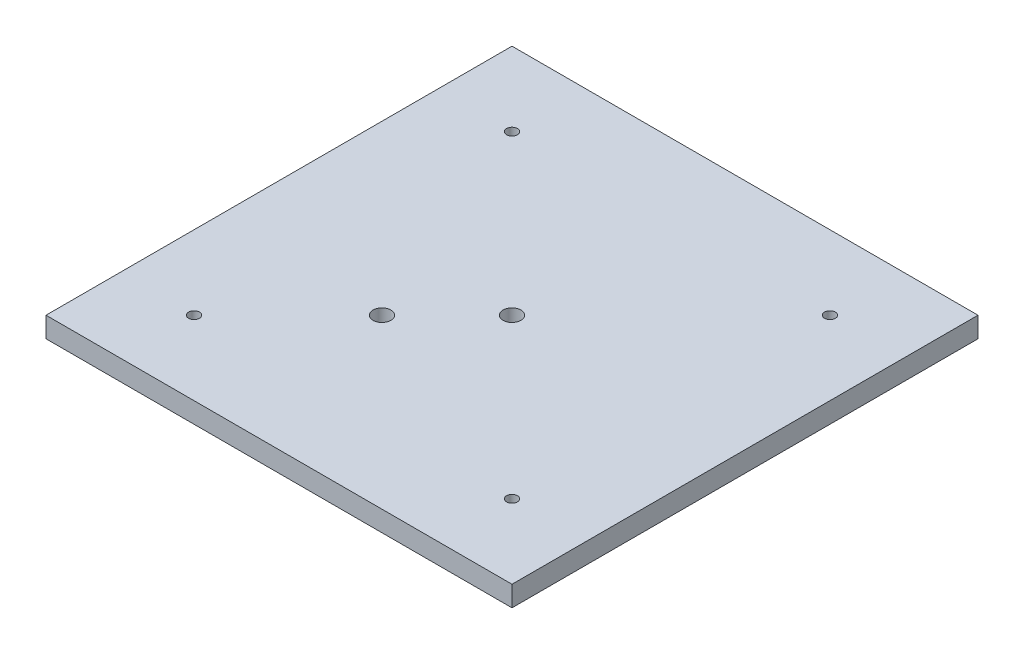
ISO-10303-21;
HEADER;
FILE_DESCRIPTION(('STEP AP214'),'2;1');
FILE_NAME('part.step','',(''),(''),'','','');
FILE_SCHEMA(('AUTOMOTIVE_DESIGN { 1 0 10303 214 1 1 1 1 }'));
ENDSEC;
DATA;
#1=APPLICATION_CONTEXT('core data for automotive mechanical design processes');
#2=APPLICATION_PROTOCOL_DEFINITION('international standard','automotive_design',2000,#1);
#3=PRODUCT_CONTEXT('',#1,'mechanical');
#4=PRODUCT('Part','Part','',(#3));
#5=PRODUCT_RELATED_PRODUCT_CATEGORY('part','',(#4));
#6=PRODUCT_DEFINITION_FORMATION('','',#4);
#7=PRODUCT_DEFINITION_CONTEXT('part definition',#1,'design');
#8=PRODUCT_DEFINITION('design','',#6,#7);
#9=PRODUCT_DEFINITION_SHAPE('','',#8);
#10=(LENGTH_UNIT() NAMED_UNIT(*) SI_UNIT(.MILLI.,.METRE.));
#11=(NAMED_UNIT(*) PLANE_ANGLE_UNIT() SI_UNIT($,.RADIAN.));
#12=(NAMED_UNIT(*) SI_UNIT($,.STERADIAN.) SOLID_ANGLE_UNIT());
#13=UNCERTAINTY_MEASURE_WITH_UNIT(LENGTH_MEASURE(1.E-05),#10,'distance_accuracy_value','');
#14=(GEOMETRIC_REPRESENTATION_CONTEXT(3) GLOBAL_UNCERTAINTY_ASSIGNED_CONTEXT((#13)) GLOBAL_UNIT_ASSIGNED_CONTEXT((#10,
#11,#12)) REPRESENTATION_CONTEXT('',''));
#15=CARTESIAN_POINT('',(0.,0.,0.));
#16=DIRECTION('',(0.,0.,1.));
#17=DIRECTION('',(1.,0.,0.));
#18=AXIS2_PLACEMENT_3D('',#15,#16,#17);
#19=CARTESIAN_POINT('',(0.,0.,0.));
#20=DIRECTION('',(0.,-1.,0.));
#21=DIRECTION('',(0.,0.,-1.));
#22=AXIS2_PLACEMENT_3D('',#19,#20,#21);
#23=PLANE('',#22);
#24=CARTESIAN_POINT('',(0.,0.,0.));
#25=DIRECTION('',(0.,1.,0.));
#26=DIRECTION('',(0.,0.,1.));
#27=AXIS2_PLACEMENT_3D('',#24,#25,#26);
#28=CIRCLE('',#27,5.5626);
#29=CARTESIAN_POINT('',(0.,0.,5.5626));
#30=VERTEX_POINT('',#29);
#31=EDGE_CURVE('E104',#30,#30,#28,.T.);
#32=ORIENTED_EDGE('',*,*,#31,.T.);
#33=EDGE_LOOP('',(#32));
#34=FACE_BOUND('',#33,.T.);
#35=CARTESIAN_POINT('',(-40.4111525448112,0.,40.4111525448112));
#36=DIRECTION('',(0.,1.,0.));
#37=DIRECTION('',(0.,0.,1.));
#38=AXIS2_PLACEMENT_3D('',#35,#36,#37);
#39=CIRCLE('',#38,5.5626);
#40=CARTESIAN_POINT('',(-40.4111525448112,0.,45.9737525448112));
#41=VERTEX_POINT('',#40);
#42=EDGE_CURVE('E120',#41,#41,#39,.T.);
#43=ORIENTED_EDGE('',*,*,#42,.T.);
#44=EDGE_LOOP('',(#43));
#45=FACE_BOUND('',#44,.T.);
#46=CARTESIAN_POINT('',(0.,0.,0.));
#47=DIRECTION('',(0.,-1.,0.));
#48=DIRECTION('',(0.,0.,-1.));
#49=AXIS2_PLACEMENT_3D('',#46,#47,#48);
#50=CIRCLE('',#49,123.19);
#51=CARTESIAN_POINT('',(0.,0.,-123.19));
#52=VERTEX_POINT('',#51);
#53=EDGE_CURVE('E139',#52,#52,#50,.T.);
#54=ORIENTED_EDGE('',*,*,#53,.T.);
#55=EDGE_LOOP('',(#54));
#56=FACE_BOUND('',#55,.T.);
#57=ADVANCED_FACE('F37',(#34,#45,#56),#23,.T.);
#58=CARTESIAN_POINT('',(144.78,12.7,144.78));
#59=DIRECTION('',(-1.,0.,0.));
#60=DIRECTION('',(0.,0.,1.));
#61=AXIS2_PLACEMENT_3D('',#58,#59,#60);
#62=PLANE('',#61);
#63=DIRECTION('',(0.,0.,-1.));
#64=VECTOR('',#63,1.);
#65=CARTESIAN_POINT('',(144.78,0.,144.78));
#66=LINE('',#65,#64);
#67=CARTESIAN_POINT('',(144.78,0.,144.78));
#68=VERTEX_POINT('',#67);
#69=CARTESIAN_POINT('',(144.78,0.,-144.78));
#70=VERTEX_POINT('',#69);
#71=EDGE_CURVE('E101',#68,#70,#66,.T.);
#72=ORIENTED_EDGE('',*,*,#71,.T.);
#73=DIRECTION('',(0.,-1.,0.));
#74=VECTOR('',#73,1.);
#75=CARTESIAN_POINT('',(144.78,12.7,-144.78));
#76=LINE('',#75,#74);
#77=CARTESIAN_POINT('',(144.78,12.7,-144.78));
#78=VERTEX_POINT('',#77);
#79=EDGE_CURVE('E11',#78,#70,#76,.T.);
#80=ORIENTED_EDGE('',*,*,#79,.F.);
#81=DIRECTION('',(0.,0.,-1.));
#82=VECTOR('',#81,1.);
#83=CARTESIAN_POINT('',(144.78,12.7,144.78));
#84=LINE('',#83,#82);
#85=CARTESIAN_POINT('',(144.78,12.7,144.78));
#86=VERTEX_POINT('',#85);
#87=EDGE_CURVE('E89',#86,#78,#84,.T.);
#88=ORIENTED_EDGE('',*,*,#87,.F.);
#89=DIRECTION('',(0.,-1.,0.));
#90=VECTOR('',#89,1.);
#91=CARTESIAN_POINT('',(144.78,12.7,144.78));
#92=LINE('',#91,#90);
#93=EDGE_CURVE('E97',#86,#68,#92,.T.);
#94=ORIENTED_EDGE('',*,*,#93,.T.);
#95=EDGE_LOOP('',(#72,#80,#88,#94));
#96=FACE_BOUND('',#95,.T.);
#97=ADVANCED_FACE('F39',(#96),#62,.F.);
#98=CARTESIAN_POINT('',(-144.78,12.7,-144.78));
#99=DIRECTION('',(0.,0.,1.));
#100=DIRECTION('',(1.,0.,0.));
#101=AXIS2_PLACEMENT_3D('',#98,#99,#100);
#102=PLANE('',#101);
#103=DIRECTION('',(-1.,0.,0.));
#104=VECTOR('',#103,1.);
#105=CARTESIAN_POINT('',(-144.78,0.,-144.78));
#106=LINE('',#105,#104);
#107=CARTESIAN_POINT('',(-144.78,0.,-144.78));
#108=VERTEX_POINT('',#107);
#109=EDGE_CURVE('E93',#70,#108,#106,.T.);
#110=ORIENTED_EDGE('',*,*,#109,.T.);
#111=DIRECTION('',(0.,-1.,0.));
#112=VECTOR('',#111,1.);
#113=CARTESIAN_POINT('',(-144.78,12.7,-144.78));
#114=LINE('',#113,#112);
#115=CARTESIAN_POINT('',(-144.78,12.7,-144.78));
#116=VERTEX_POINT('',#115);
#117=EDGE_CURVE('E46',#116,#108,#114,.T.);
#118=ORIENTED_EDGE('',*,*,#117,.F.);
#119=DIRECTION('',(-1.,0.,0.));
#120=VECTOR('',#119,1.);
#121=CARTESIAN_POINT('',(-144.78,12.7,-144.78));
#122=LINE('',#121,#120);
#123=EDGE_CURVE('E84',#78,#116,#122,.T.);
#124=ORIENTED_EDGE('',*,*,#123,.F.);
#125=ORIENTED_EDGE('',*,*,#79,.T.);
#126=EDGE_LOOP('',(#110,#118,#124,#125));
#127=FACE_BOUND('',#126,.T.);
#128=ADVANCED_FACE('F92',(#127),#102,.F.);
#129=CARTESIAN_POINT('',(-144.78,12.7,144.78));
#130=DIRECTION('',(1.,0.,0.));
#131=DIRECTION('',(0.,0.,-1.));
#132=AXIS2_PLACEMENT_3D('',#129,#130,#131);
#133=PLANE('',#132);
#134=DIRECTION('',(0.,0.,1.));
#135=VECTOR('',#134,1.);
#136=CARTESIAN_POINT('',(-144.78,0.,144.78));
#137=LINE('',#136,#135);
#138=CARTESIAN_POINT('',(-144.78,0.,144.78));
#139=VERTEX_POINT('',#138);
#140=EDGE_CURVE('E71',#108,#139,#137,.T.);
#141=ORIENTED_EDGE('',*,*,#140,.T.);
#142=DIRECTION('',(0.,-1.,0.));
#143=VECTOR('',#142,1.);
#144=CARTESIAN_POINT('',(-144.78,12.7,144.78));
#145=LINE('',#144,#143);
#146=CARTESIAN_POINT('',(-144.78,12.7,144.78));
#147=VERTEX_POINT('',#146);
#148=EDGE_CURVE('E94',#147,#139,#145,.T.);
#149=ORIENTED_EDGE('',*,*,#148,.F.);
#150=DIRECTION('',(0.,0.,1.));
#151=VECTOR('',#150,1.);
#152=CARTESIAN_POINT('',(-144.78,12.7,144.78));
#153=LINE('',#152,#151);
#154=EDGE_CURVE('E87',#116,#147,#153,.T.);
#155=ORIENTED_EDGE('',*,*,#154,.F.);
#156=ORIENTED_EDGE('',*,*,#117,.T.);
#157=EDGE_LOOP('',(#141,#149,#155,#156));
#158=FACE_BOUND('',#157,.T.);
#159=ADVANCED_FACE('F95',(#158),#133,.F.);
#160=CARTESIAN_POINT('',(-144.78,12.7,144.78));
#161=DIRECTION('',(0.,0.,-1.));
#162=DIRECTION('',(-1.,0.,0.));
#163=AXIS2_PLACEMENT_3D('',#160,#161,#162);
#164=PLANE('',#163);
#165=DIRECTION('',(1.,0.,0.));
#166=VECTOR('',#165,1.);
#167=CARTESIAN_POINT('',(-144.78,0.,144.78));
#168=LINE('',#167,#166);
#169=EDGE_CURVE('E77',#139,#68,#168,.T.);
#170=ORIENTED_EDGE('',*,*,#169,.T.);
#171=ORIENTED_EDGE('',*,*,#93,.F.);
#172=DIRECTION('',(1.,0.,0.));
#173=VECTOR('',#172,1.);
#174=CARTESIAN_POINT('',(-144.78,12.7,144.78));
#175=LINE('',#174,#173);
#176=EDGE_CURVE('E54',#147,#86,#175,.T.);
#177=ORIENTED_EDGE('',*,*,#176,.F.);
#178=ORIENTED_EDGE('',*,*,#148,.T.);
#179=EDGE_LOOP('',(#170,#171,#177,#178));
#180=FACE_BOUND('',#179,.T.);
#181=ADVANCED_FACE('F109',(#180),#164,.F.);
#182=CARTESIAN_POINT('',(0.,12.7,0.));
#183=DIRECTION('',(0.,-1.,0.));
#184=DIRECTION('',(0.,0.,-1.));
#185=AXIS2_PLACEMENT_3D('',#182,#183,#184);
#186=PLANE('',#185);
#187=CARTESIAN_POINT('',(98.7828173317595,12.7,98.7828173317619));
#188=DIRECTION('',(0.,1.,0.));
#189=DIRECTION('',(0.,0.,1.));
#190=AXIS2_PLACEMENT_3D('',#187,#188,#189);
#191=CIRCLE('',#190,3.37819999999998);
#192=CARTESIAN_POINT('',(98.7828173317595,12.7,102.161017331762));
#193=VERTEX_POINT('',#192);
#194=EDGE_CURVE('E159',#193,#193,#191,.T.);
#195=ORIENTED_EDGE('',*,*,#194,.F.);
#196=EDGE_LOOP('',(#195));
#197=FACE_BOUND('',#196,.T.);
#198=CARTESIAN_POINT('',(98.7828173317609,12.7,-98.7828173317605));
#199=DIRECTION('',(0.,1.,0.));
#200=DIRECTION('',(0.,0.,1.));
#201=AXIS2_PLACEMENT_3D('',#198,#199,#200);
#202=CIRCLE('',#201,3.37819999999998);
#203=CARTESIAN_POINT('',(98.7828173317609,12.7,-95.4046173317605));
#204=VERTEX_POINT('',#203);
#205=EDGE_CURVE('E153',#204,#204,#202,.T.);
#206=ORIENTED_EDGE('',*,*,#205,.F.);
#207=EDGE_LOOP('',(#206));
#208=FACE_BOUND('',#207,.T.);
#209=CARTESIAN_POINT('',(-98.7828173317602,12.7,-98.7828173317612));
#210=DIRECTION('',(0.,1.,0.));
#211=DIRECTION('',(0.,0.,1.));
#212=AXIS2_PLACEMENT_3D('',#209,#210,#211);
#213=CIRCLE('',#212,3.37819999999998);
#214=CARTESIAN_POINT('',(-98.7828173317602,12.7,-95.4046173317612));
#215=VERTEX_POINT('',#214);
#216=EDGE_CURVE('E147',#215,#215,#213,.T.);
#217=ORIENTED_EDGE('',*,*,#216,.F.);
#218=EDGE_LOOP('',(#217));
#219=FACE_BOUND('',#218,.T.);
#220=CARTESIAN_POINT('',(-98.7828173317609,12.7,98.7828173317605));
#221=DIRECTION('',(0.,1.,0.));
#222=DIRECTION('',(0.,0.,1.));
#223=AXIS2_PLACEMENT_3D('',#220,#221,#222);
#224=CIRCLE('',#223,3.37819999999998);
#225=CARTESIAN_POINT('',(-98.7828173317609,12.7,102.161017331761));
#226=VERTEX_POINT('',#225);
#227=EDGE_CURVE('E129',#226,#226,#224,.T.);
#228=ORIENTED_EDGE('',*,*,#227,.F.);
#229=EDGE_LOOP('',(#228));
#230=FACE_BOUND('',#229,.T.);
#231=CARTESIAN_POINT('',(-40.4111525448112,12.7,40.4111525448112));
#232=DIRECTION('',(0.,1.,0.));
#233=DIRECTION('',(0.,0.,1.));
#234=AXIS2_PLACEMENT_3D('',#231,#232,#233);
#235=CIRCLE('',#234,5.5626);
#236=CARTESIAN_POINT('',(-40.4111525448112,12.7,45.9737525448112));
#237=VERTEX_POINT('',#236);
#238=EDGE_CURVE('E123',#237,#237,#235,.T.);
#239=ORIENTED_EDGE('',*,*,#238,.F.);
#240=EDGE_LOOP('',(#239));
#241=FACE_BOUND('',#240,.T.);
#242=CARTESIAN_POINT('',(0.,12.7,0.));
#243=DIRECTION('',(0.,1.,0.));
#244=DIRECTION('',(0.,0.,1.));
#245=AXIS2_PLACEMENT_3D('',#242,#243,#244);
#246=CIRCLE('',#245,5.5626);
#247=CARTESIAN_POINT('',(0.,12.7,5.5626));
#248=VERTEX_POINT('',#247);
#249=EDGE_CURVE('E117',#248,#248,#246,.T.);
#250=ORIENTED_EDGE('',*,*,#249,.F.);
#251=EDGE_LOOP('',(#250));
#252=FACE_BOUND('',#251,.T.);
#253=ORIENTED_EDGE('',*,*,#87,.T.);
#254=ORIENTED_EDGE('',*,*,#123,.T.);
#255=ORIENTED_EDGE('',*,*,#154,.T.);
#256=ORIENTED_EDGE('',*,*,#176,.T.);
#257=EDGE_LOOP('',(#253,#254,#255,#256));
#258=FACE_BOUND('',#257,.T.);
#259=ADVANCED_FACE('F85',(#197,#208,#219,#230,#241,#252,#258),#186,.F.);
#260=CARTESIAN_POINT('',(98.7828173317595,0.,98.7828173317619));
#261=DIRECTION('',(0.,1.,0.));
#262=DIRECTION('',(0.,0.,1.));
#263=AXIS2_PLACEMENT_3D('',#260,#261,#262);
#264=CIRCLE('',#263,3.3782);
#265=CARTESIAN_POINT('',(98.7828173317595,0.,102.161017331762));
#266=VERTEX_POINT('',#265);
#267=EDGE_CURVE('E156',#266,#266,#264,.T.);
#268=ORIENTED_EDGE('',*,*,#267,.T.);
#269=EDGE_LOOP('',(#268));
#270=FACE_BOUND('',#269,.T.);
#271=CARTESIAN_POINT('',(98.7828173317609,0.,-98.7828173317605));
#272=DIRECTION('',(0.,1.,0.));
#273=DIRECTION('',(0.,0.,1.));
#274=AXIS2_PLACEMENT_3D('',#271,#272,#273);
#275=CIRCLE('',#274,3.3782);
#276=CARTESIAN_POINT('',(98.7828173317609,0.,-95.4046173317605));
#277=VERTEX_POINT('',#276);
#278=EDGE_CURVE('E150',#277,#277,#275,.T.);
#279=ORIENTED_EDGE('',*,*,#278,.T.);
#280=EDGE_LOOP('',(#279));
#281=FACE_BOUND('',#280,.T.);
#282=CARTESIAN_POINT('',(-98.7828173317602,0.,-98.7828173317612));
#283=DIRECTION('',(0.,1.,0.));
#284=DIRECTION('',(0.,0.,1.));
#285=AXIS2_PLACEMENT_3D('',#282,#283,#284);
#286=CIRCLE('',#285,3.3782);
#287=CARTESIAN_POINT('',(-98.7828173317602,0.,-95.4046173317612));
#288=VERTEX_POINT('',#287);
#289=EDGE_CURVE('E142',#288,#288,#286,.T.);
#290=ORIENTED_EDGE('',*,*,#289,.T.);
#291=EDGE_LOOP('',(#290));
#292=FACE_BOUND('',#291,.T.);
#293=CARTESIAN_POINT('',(0.,0.,0.));
#294=DIRECTION('',(0.,-1.,0.));
#295=DIRECTION('',(0.,0.,-1.));
#296=AXIS2_PLACEMENT_3D('',#293,#294,#295);
#297=CIRCLE('',#296,127.635);
#298=CARTESIAN_POINT('',(0.,0.,-127.635));
#299=VERTEX_POINT('',#298);
#300=EDGE_CURVE('E133',#299,#299,#297,.T.);
#301=ORIENTED_EDGE('',*,*,#300,.F.);
#302=EDGE_LOOP('',(#301));
#303=FACE_BOUND('',#302,.T.);
#304=CARTESIAN_POINT('',(-98.7828173317609,0.,98.7828173317605));
#305=DIRECTION('',(0.,1.,0.));
#306=DIRECTION('',(0.,0.,1.));
#307=AXIS2_PLACEMENT_3D('',#304,#305,#306);
#308=CIRCLE('',#307,3.3782);
#309=CARTESIAN_POINT('',(-98.7828173317609,0.,102.161017331761));
#310=VERTEX_POINT('',#309);
#311=EDGE_CURVE('E126',#310,#310,#308,.T.);
#312=ORIENTED_EDGE('',*,*,#311,.T.);
#313=EDGE_LOOP('',(#312));
#314=FACE_BOUND('',#313,.T.);
#315=ORIENTED_EDGE('',*,*,#71,.F.);
#316=ORIENTED_EDGE('',*,*,#169,.F.);
#317=ORIENTED_EDGE('',*,*,#140,.F.);
#318=ORIENTED_EDGE('',*,*,#109,.F.);
#319=EDGE_LOOP('',(#315,#316,#317,#318));
#320=FACE_BOUND('',#319,.T.);
#321=ADVANCED_FACE('F112',(#270,#281,#292,#303,#314,#320),#23,.T.);
#322=CARTESIAN_POINT('',(0.,12.7,0.));
#323=DIRECTION('',(0.,1.,0.));
#324=DIRECTION('',(0.,0.,1.));
#325=AXIS2_PLACEMENT_3D('',#322,#323,#324);
#326=CYLINDRICAL_SURFACE('',#325,5.5626);
#327=ORIENTED_EDGE('',*,*,#31,.F.);
#328=EDGE_LOOP('',(#327));
#329=FACE_BOUND('',#328,.T.);
#330=ORIENTED_EDGE('',*,*,#249,.T.);
#331=EDGE_LOOP('',(#330));
#332=FACE_BOUND('',#331,.T.);
#333=ADVANCED_FACE('F178',(#329,#332),#326,.F.);
#334=CARTESIAN_POINT('',(-40.4111525448112,12.7,40.4111525448112));
#335=DIRECTION('',(0.,1.,0.));
#336=DIRECTION('',(0.,0.,1.));
#337=AXIS2_PLACEMENT_3D('',#334,#335,#336);
#338=CYLINDRICAL_SURFACE('',#337,5.5626);
#339=ORIENTED_EDGE('',*,*,#42,.F.);
#340=EDGE_LOOP('',(#339));
#341=FACE_BOUND('',#340,.T.);
#342=ORIENTED_EDGE('',*,*,#238,.T.);
#343=EDGE_LOOP('',(#342));
#344=FACE_BOUND('',#343,.T.);
#345=ADVANCED_FACE('F180',(#341,#344),#338,.F.);
#346=CARTESIAN_POINT('',(-98.7828173317609,12.7,98.7828173317605));
#347=DIRECTION('',(0.,1.,0.));
#348=DIRECTION('',(0.,0.,1.));
#349=AXIS2_PLACEMENT_3D('',#346,#347,#348);
#350=CYLINDRICAL_SURFACE('',#349,3.37819999999999);
#351=ORIENTED_EDGE('',*,*,#311,.F.);
#352=EDGE_LOOP('',(#351));
#353=FACE_BOUND('',#352,.T.);
#354=ORIENTED_EDGE('',*,*,#227,.T.);
#355=EDGE_LOOP('',(#354));
#356=FACE_BOUND('',#355,.T.);
#357=ADVANCED_FACE('F187',(#353,#356),#350,.F.);
#358=CARTESIAN_POINT('',(0.,9.525,0.));
#359=DIRECTION('',(0.,-1.,0.));
#360=DIRECTION('',(0.,0.,-1.));
#361=AXIS2_PLACEMENT_3D('',#358,#359,#360);
#362=CYLINDRICAL_SURFACE('',#361,127.635);
#363=CARTESIAN_POINT('',(0.,9.525,0.));
#364=DIRECTION('',(0.,-1.,0.));
#365=DIRECTION('',(0.,0.,-1.));
#366=AXIS2_PLACEMENT_3D('',#363,#364,#365);
#367=CIRCLE('',#366,127.635);
#368=CARTESIAN_POINT('',(0.,9.525,-127.635));
#369=VERTEX_POINT('',#368);
#370=EDGE_CURVE('E132',#369,#369,#367,.T.);
#371=ORIENTED_EDGE('',*,*,#370,.F.);
#372=EDGE_LOOP('',(#371));
#373=FACE_BOUND('',#372,.T.);
#374=ORIENTED_EDGE('',*,*,#300,.T.);
#375=EDGE_LOOP('',(#374));
#376=FACE_BOUND('',#375,.T.);
#377=ADVANCED_FACE('F279',(#373,#376),#362,.F.);
#378=CARTESIAN_POINT('',(0.,9.525,0.));
#379=DIRECTION('',(0.,-1.,0.));
#380=DIRECTION('',(0.,0.,-1.));
#381=AXIS2_PLACEMENT_3D('',#378,#379,#380);
#382=PLANE('',#381);
#383=CARTESIAN_POINT('',(0.,9.525,0.));
#384=DIRECTION('',(0.,-1.,0.));
#385=DIRECTION('',(0.,0.,-1.));
#386=AXIS2_PLACEMENT_3D('',#383,#384,#385);
#387=CIRCLE('',#386,123.19);
#388=CARTESIAN_POINT('',(0.,9.525,-123.19));
#389=VERTEX_POINT('',#388);
#390=EDGE_CURVE('E136',#389,#389,#387,.T.);
#391=ORIENTED_EDGE('',*,*,#390,.F.);
#392=EDGE_LOOP('',(#391));
#393=FACE_BOUND('',#392,.T.);
#394=ORIENTED_EDGE('',*,*,#370,.T.);
#395=EDGE_LOOP('',(#394));
#396=FACE_BOUND('',#395,.T.);
#397=ADVANCED_FACE('F272',(#393,#396),#382,.T.);
#398=CARTESIAN_POINT('',(0.,9.525,0.));
#399=DIRECTION('',(0.,-1.,0.));
#400=DIRECTION('',(0.,0.,-1.));
#401=AXIS2_PLACEMENT_3D('',#398,#399,#400);
#402=CYLINDRICAL_SURFACE('',#401,123.19);
#403=ORIENTED_EDGE('',*,*,#390,.T.);
#404=EDGE_LOOP('',(#403));
#405=FACE_BOUND('',#404,.T.);
#406=ORIENTED_EDGE('',*,*,#53,.F.);
#407=EDGE_LOOP('',(#406));
#408=FACE_BOUND('',#407,.T.);
#409=ADVANCED_FACE('F239',(#405,#408),#402,.T.);
#410=CARTESIAN_POINT('',(-98.7828173317602,12.7,-98.7828173317612));
#411=DIRECTION('',(0.,1.,0.));
#412=DIRECTION('',(0.,0.,1.));
#413=AXIS2_PLACEMENT_3D('',#410,#411,#412);
#414=CYLINDRICAL_SURFACE('',#413,3.37819999999999);
#415=ORIENTED_EDGE('',*,*,#289,.F.);
#416=EDGE_LOOP('',(#415));
#417=FACE_BOUND('',#416,.T.);
#418=ORIENTED_EDGE('',*,*,#216,.T.);
#419=EDGE_LOOP('',(#418));
#420=FACE_BOUND('',#419,.T.);
#421=ADVANCED_FACE('F232',(#417,#420),#414,.F.);
#422=CARTESIAN_POINT('',(98.7828173317609,12.7,-98.7828173317605));
#423=DIRECTION('',(0.,1.,0.));
#424=DIRECTION('',(0.,0.,1.));
#425=AXIS2_PLACEMENT_3D('',#422,#423,#424);
#426=CYLINDRICAL_SURFACE('',#425,3.37819999999999);
#427=ORIENTED_EDGE('',*,*,#278,.F.);
#428=EDGE_LOOP('',(#427));
#429=FACE_BOUND('',#428,.T.);
#430=ORIENTED_EDGE('',*,*,#205,.T.);
#431=EDGE_LOOP('',(#430));
#432=FACE_BOUND('',#431,.T.);
#433=ADVANCED_FACE('F238',(#429,#432),#426,.F.);
#434=CARTESIAN_POINT('',(98.7828173317595,12.7,98.7828173317619));
#435=DIRECTION('',(0.,1.,0.));
#436=DIRECTION('',(0.,0.,1.));
#437=AXIS2_PLACEMENT_3D('',#434,#435,#436);
#438=CYLINDRICAL_SURFACE('',#437,3.37819999999999);
#439=ORIENTED_EDGE('',*,*,#267,.F.);
#440=EDGE_LOOP('',(#439));
#441=FACE_BOUND('',#440,.T.);
#442=ORIENTED_EDGE('',*,*,#194,.T.);
#443=EDGE_LOOP('',(#442));
#444=FACE_BOUND('',#443,.T.);
#445=ADVANCED_FACE('F163',(#441,#444),#438,.F.);
#446=CLOSED_SHELL('',(#57,#97,#128,#159,#181,#259,#321,#333,#345,#357,#377,#397,#409,#421,#433,#445));
#447=MANIFOLD_SOLID_BREP('B2',#446);
#448=ADVANCED_BREP_SHAPE_REPRESENTATION('',(#18,#447),#14);
#449=SHAPE_DEFINITION_REPRESENTATION(#9,#448);
ENDSEC;
END-ISO-10303-21;
